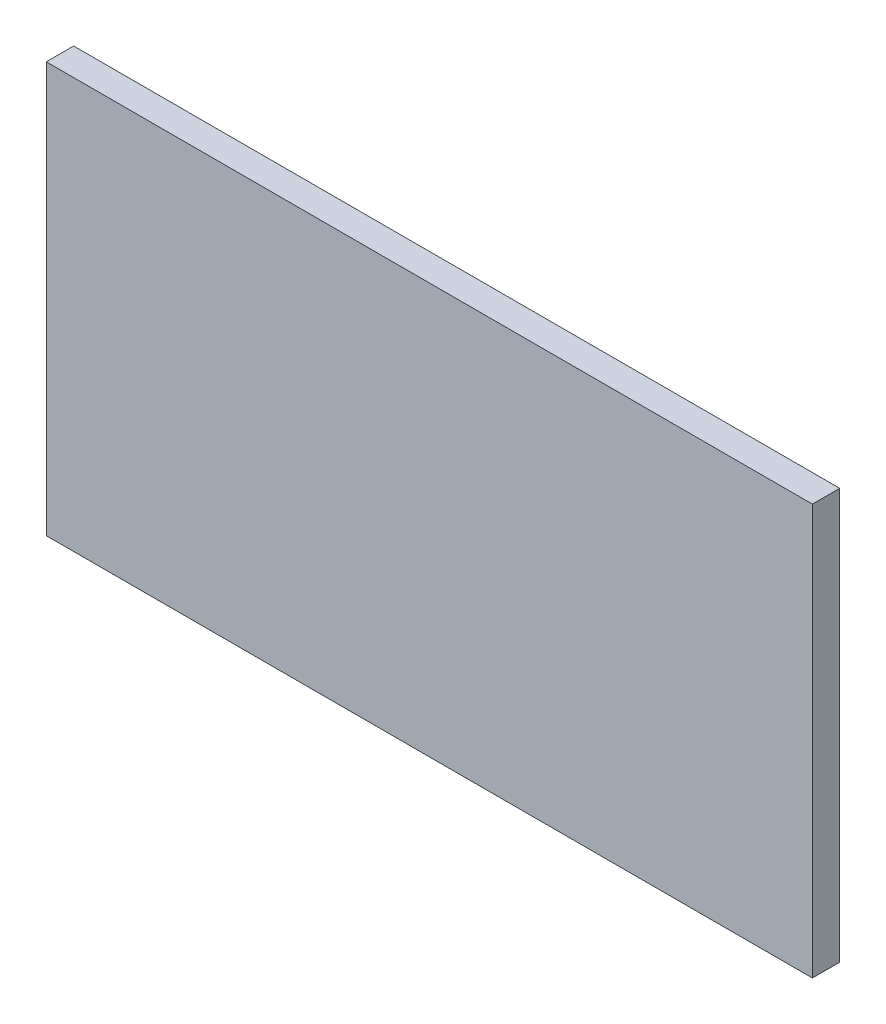
ISO-10303-21;
HEADER;
FILE_DESCRIPTION(('STEP AP214'),'2;1');
FILE_NAME('part.step','',(''),(''),'','','');
FILE_SCHEMA(('AUTOMOTIVE_DESIGN { 1 0 10303 214 1 1 1 1 }'));
ENDSEC;
DATA;
#1=APPLICATION_CONTEXT('core data for automotive mechanical design processes');
#2=APPLICATION_PROTOCOL_DEFINITION('international standard','automotive_design',2000,#1);
#3=PRODUCT_CONTEXT('',#1,'mechanical');
#4=PRODUCT('Part','Part','',(#3));
#5=PRODUCT_RELATED_PRODUCT_CATEGORY('part','',(#4));
#6=PRODUCT_DEFINITION_FORMATION('','',#4);
#7=PRODUCT_DEFINITION_CONTEXT('part definition',#1,'design');
#8=PRODUCT_DEFINITION('design','',#6,#7);
#9=PRODUCT_DEFINITION_SHAPE('','',#8);
#10=(LENGTH_UNIT() NAMED_UNIT(*) SI_UNIT(.MILLI.,.METRE.));
#11=(NAMED_UNIT(*) PLANE_ANGLE_UNIT() SI_UNIT($,.RADIAN.));
#12=(NAMED_UNIT(*) SI_UNIT($,.STERADIAN.) SOLID_ANGLE_UNIT());
#13=UNCERTAINTY_MEASURE_WITH_UNIT(LENGTH_MEASURE(1.E-05),#10,'distance_accuracy_value','');
#14=(GEOMETRIC_REPRESENTATION_CONTEXT(3) GLOBAL_UNCERTAINTY_ASSIGNED_CONTEXT((#13)) GLOBAL_UNIT_ASSIGNED_CONTEXT((#10,
#11,#12)) REPRESENTATION_CONTEXT('',''));
#15=CARTESIAN_POINT('',(0.,0.,0.));
#16=DIRECTION('',(0.,0.,1.));
#17=DIRECTION('',(1.,0.,0.));
#18=AXIS2_PLACEMENT_3D('',#15,#16,#17);
#19=CARTESIAN_POINT('',(88.9,47.625,6.35));
#20=DIRECTION('',(-1.,0.,0.));
#21=DIRECTION('',(0.,0.,1.));
#22=AXIS2_PLACEMENT_3D('',#19,#20,#21);
#23=PLANE('',#22);
#24=DIRECTION('',(0.,1.,0.));
#25=VECTOR('',#24,1.);
#26=CARTESIAN_POINT('',(88.9,47.625,0.));
#27=LINE('',#26,#25);
#28=CARTESIAN_POINT('',(88.9,-47.625,0.));
#29=VERTEX_POINT('',#28);
#30=CARTESIAN_POINT('',(88.9,47.625,0.));
#31=VERTEX_POINT('',#30);
#32=EDGE_CURVE('E98',#29,#31,#27,.T.);
#33=ORIENTED_EDGE('',*,*,#32,.T.);
#34=DIRECTION('',(0.,0.,-1.));
#35=VECTOR('',#34,1.);
#36=CARTESIAN_POINT('',(88.9,47.625,6.35));
#37=LINE('',#36,#35);
#38=CARTESIAN_POINT('',(88.9,47.625,6.35));
#39=VERTEX_POINT('',#38);
#40=EDGE_CURVE('E11',#39,#31,#37,.T.);
#41=ORIENTED_EDGE('',*,*,#40,.F.);
#42=DIRECTION('',(0.,1.,0.));
#43=VECTOR('',#42,1.);
#44=CARTESIAN_POINT('',(88.9,47.625,6.35));
#45=LINE('',#44,#43);
#46=CARTESIAN_POINT('',(88.9,-47.625,6.35));
#47=VERTEX_POINT('',#46);
#48=EDGE_CURVE('E86',#47,#39,#45,.T.);
#49=ORIENTED_EDGE('',*,*,#48,.F.);
#50=DIRECTION('',(0.,0.,-1.));
#51=VECTOR('',#50,1.);
#52=CARTESIAN_POINT('',(88.9,-47.625,6.35));
#53=LINE('',#52,#51);
#54=EDGE_CURVE('E94',#47,#29,#53,.T.);
#55=ORIENTED_EDGE('',*,*,#54,.T.);
#56=EDGE_LOOP('',(#33,#41,#49,#55));
#57=FACE_BOUND('',#56,.T.);
#58=ADVANCED_FACE('F35',(#57),#23,.F.);
#59=CARTESIAN_POINT('',(-88.9,47.625,6.35));
#60=DIRECTION('',(0.,-1.,0.));
#61=DIRECTION('',(0.,0.,-1.));
#62=AXIS2_PLACEMENT_3D('',#59,#60,#61);
#63=PLANE('',#62);
#64=DIRECTION('',(-1.,0.,0.));
#65=VECTOR('',#64,1.);
#66=CARTESIAN_POINT('',(-88.9,47.625,0.));
#67=LINE('',#66,#65);
#68=CARTESIAN_POINT('',(-88.9,47.625,0.));
#69=VERTEX_POINT('',#68);
#70=EDGE_CURVE('E90',#31,#69,#67,.T.);
#71=ORIENTED_EDGE('',*,*,#70,.T.);
#72=DIRECTION('',(0.,0.,-1.));
#73=VECTOR('',#72,1.);
#74=CARTESIAN_POINT('',(-88.9,47.625,6.35));
#75=LINE('',#74,#73);
#76=CARTESIAN_POINT('',(-88.9,47.625,6.35));
#77=VERTEX_POINT('',#76);
#78=EDGE_CURVE('E43',#77,#69,#75,.T.);
#79=ORIENTED_EDGE('',*,*,#78,.F.);
#80=DIRECTION('',(-1.,0.,0.));
#81=VECTOR('',#80,1.);
#82=CARTESIAN_POINT('',(-88.9,47.625,6.35));
#83=LINE('',#82,#81);
#84=EDGE_CURVE('E81',#39,#77,#83,.T.);
#85=ORIENTED_EDGE('',*,*,#84,.F.);
#86=ORIENTED_EDGE('',*,*,#40,.T.);
#87=EDGE_LOOP('',(#71,#79,#85,#86));
#88=FACE_BOUND('',#87,.T.);
#89=ADVANCED_FACE('F89',(#88),#63,.F.);
#90=CARTESIAN_POINT('',(-88.9,47.625,6.35));
#91=DIRECTION('',(1.,0.,0.));
#92=DIRECTION('',(0.,0.,-1.));
#93=AXIS2_PLACEMENT_3D('',#90,#91,#92);
#94=PLANE('',#93);
#95=DIRECTION('',(0.,-1.,0.));
#96=VECTOR('',#95,1.);
#97=CARTESIAN_POINT('',(-88.9,47.625,0.));
#98=LINE('',#97,#96);
#99=CARTESIAN_POINT('',(-88.9,-47.625,0.));
#100=VERTEX_POINT('',#99);
#101=EDGE_CURVE('E68',#69,#100,#98,.T.);
#102=ORIENTED_EDGE('',*,*,#101,.T.);
#103=DIRECTION('',(0.,0.,-1.));
#104=VECTOR('',#103,1.);
#105=CARTESIAN_POINT('',(-88.9,-47.625,6.35));
#106=LINE('',#105,#104);
#107=CARTESIAN_POINT('',(-88.9,-47.625,6.35));
#108=VERTEX_POINT('',#107);
#109=EDGE_CURVE('E91',#108,#100,#106,.T.);
#110=ORIENTED_EDGE('',*,*,#109,.F.);
#111=DIRECTION('',(0.,-1.,0.));
#112=VECTOR('',#111,1.);
#113=CARTESIAN_POINT('',(-88.9,47.625,6.35));
#114=LINE('',#113,#112);
#115=EDGE_CURVE('E84',#77,#108,#114,.T.);
#116=ORIENTED_EDGE('',*,*,#115,.F.);
#117=ORIENTED_EDGE('',*,*,#78,.T.);
#118=EDGE_LOOP('',(#102,#110,#116,#117));
#119=FACE_BOUND('',#118,.T.);
#120=ADVANCED_FACE('F92',(#119),#94,.F.);
#121=CARTESIAN_POINT('',(-88.9,-47.625,6.35));
#122=DIRECTION('',(0.,1.,0.));
#123=DIRECTION('',(0.,0.,1.));
#124=AXIS2_PLACEMENT_3D('',#121,#122,#123);
#125=PLANE('',#124);
#126=DIRECTION('',(1.,0.,0.));
#127=VECTOR('',#126,1.);
#128=CARTESIAN_POINT('',(-88.9,-47.625,0.));
#129=LINE('',#128,#127);
#130=EDGE_CURVE('E74',#100,#29,#129,.T.);
#131=ORIENTED_EDGE('',*,*,#130,.T.);
#132=ORIENTED_EDGE('',*,*,#54,.F.);
#133=DIRECTION('',(1.,0.,0.));
#134=VECTOR('',#133,1.);
#135=CARTESIAN_POINT('',(-88.9,-47.625,6.35));
#136=LINE('',#135,#134);
#137=EDGE_CURVE('E51',#108,#47,#136,.T.);
#138=ORIENTED_EDGE('',*,*,#137,.F.);
#139=ORIENTED_EDGE('',*,*,#109,.T.);
#140=EDGE_LOOP('',(#131,#132,#138,#139));
#141=FACE_BOUND('',#140,.T.);
#142=ADVANCED_FACE('F105',(#141),#125,.F.);
#143=CARTESIAN_POINT('',(0.,0.,6.35));
#144=DIRECTION('',(0.,0.,1.));
#145=DIRECTION('',(1.,0.,0.));
#146=AXIS2_PLACEMENT_3D('',#143,#144,#145);
#147=PLANE('',#146);
#148=ORIENTED_EDGE('',*,*,#48,.T.);
#149=ORIENTED_EDGE('',*,*,#84,.T.);
#150=ORIENTED_EDGE('',*,*,#115,.T.);
#151=ORIENTED_EDGE('',*,*,#137,.T.);
#152=EDGE_LOOP('',(#148,#149,#150,#151));
#153=FACE_BOUND('',#152,.T.);
#154=ADVANCED_FACE('F82',(#153),#147,.T.);
#155=CARTESIAN_POINT('',(0.,0.,0.));
#156=DIRECTION('',(0.,0.,1.));
#157=DIRECTION('',(1.,0.,0.));
#158=AXIS2_PLACEMENT_3D('',#155,#156,#157);
#159=PLANE('',#158);
#160=ORIENTED_EDGE('',*,*,#32,.F.);
#161=ORIENTED_EDGE('',*,*,#130,.F.);
#162=ORIENTED_EDGE('',*,*,#101,.F.);
#163=ORIENTED_EDGE('',*,*,#70,.F.);
#164=EDGE_LOOP('',(#160,#161,#162,#163));
#165=FACE_BOUND('',#164,.T.);
#166=ADVANCED_FACE('F108',(#165),#159,.F.);
#167=CLOSED_SHELL('',(#58,#89,#120,#142,#154,#166));
#168=MANIFOLD_SOLID_BREP('B2',#167);
#169=ADVANCED_BREP_SHAPE_REPRESENTATION('',(#18,#168),#14);
#170=SHAPE_DEFINITION_REPRESENTATION(#9,#169);
ENDSEC;
END-ISO-10303-21;
